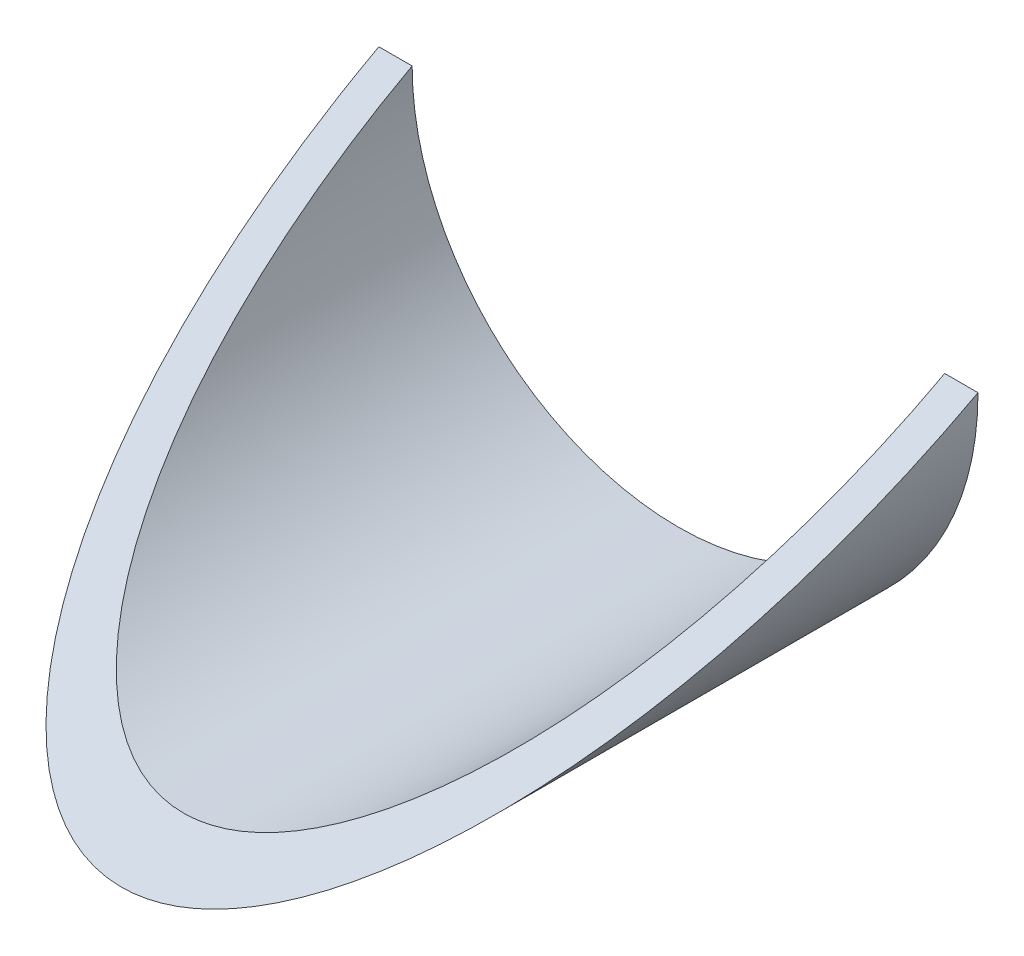
ISO-10303-21;
HEADER;
FILE_DESCRIPTION(('STEP AP214'),'2;1');
FILE_NAME('part.step','',(''),(''),'','','');
FILE_SCHEMA(('AUTOMOTIVE_DESIGN { 1 0 10303 214 1 1 1 1 }'));
ENDSEC;
DATA;
#1=APPLICATION_CONTEXT('core data for automotive mechanical design processes');
#2=APPLICATION_PROTOCOL_DEFINITION('international standard','automotive_design',2000,#1);
#3=PRODUCT_CONTEXT('',#1,'mechanical');
#4=PRODUCT('Part','Part','',(#3));
#5=PRODUCT_RELATED_PRODUCT_CATEGORY('part','',(#4));
#6=PRODUCT_DEFINITION_FORMATION('','',#4);
#7=PRODUCT_DEFINITION_CONTEXT('part definition',#1,'design');
#8=PRODUCT_DEFINITION('design','',#6,#7);
#9=PRODUCT_DEFINITION_SHAPE('','',#8);
#10=(LENGTH_UNIT() NAMED_UNIT(*) SI_UNIT(.MILLI.,.METRE.));
#11=(NAMED_UNIT(*) PLANE_ANGLE_UNIT() SI_UNIT($,.RADIAN.));
#12=(NAMED_UNIT(*) SI_UNIT($,.STERADIAN.) SOLID_ANGLE_UNIT());
#13=UNCERTAINTY_MEASURE_WITH_UNIT(LENGTH_MEASURE(1.E-05),#10,'distance_accuracy_value','');
#14=(GEOMETRIC_REPRESENTATION_CONTEXT(3) GLOBAL_UNCERTAINTY_ASSIGNED_CONTEXT((#13)) GLOBAL_UNIT_ASSIGNED_CONTEXT((#10,
#11,#12)) REPRESENTATION_CONTEXT('',''));
#15=CARTESIAN_POINT('',(0.,0.,0.));
#16=DIRECTION('',(0.,0.,1.));
#17=DIRECTION('',(1.,0.,0.));
#18=AXIS2_PLACEMENT_3D('',#15,#16,#17);
#19=CARTESIAN_POINT('',(0.,0.,-127.));
#20=DIRECTION('',(0.,0.,1.));
#21=DIRECTION('',(1.,0.,0.));
#22=AXIS2_PLACEMENT_3D('',#19,#20,#21);
#23=CYLINDRICAL_SURFACE('',#22,57.15);
#24=CARTESIAN_POINT('',(0.,0.,-106.255823369828));
#25=DIRECTION('',(0.,-0.880694764772711,-0.473684210526316));
#26=DIRECTION('',(0.,-0.473684210526316,0.880694764772711));
#27=AXIS2_PLACEMENT_3D('',#24,#25,#26);
#28=ELLIPSE('',#27,120.65,57.15);
#29=CARTESIAN_POINT('',(-57.15,0.,-106.255823369828));
#30=VERTEX_POINT('',#29);
#31=CARTESIAN_POINT('',(57.15,0.,-106.255823369828));
#32=VERTEX_POINT('',#31);
#33=EDGE_CURVE('E40',#30,#32,#28,.F.);
#34=ORIENTED_EDGE('',*,*,#33,.F.);
#35=CARTESIAN_POINT('',(0.,0.,-106.255823369828));
#36=DIRECTION('',(0.,0.,-1.));
#37=DIRECTION('',(-1.,0.,0.));
#38=AXIS2_PLACEMENT_3D('',#35,#36,#37);
#39=CIRCLE('',#38,57.15);
#40=EDGE_CURVE('E47',#30,#32,#39,.F.);
#41=ORIENTED_EDGE('',*,*,#40,.T.);
#42=EDGE_LOOP('',(#34,#41));
#43=FACE_BOUND('',#42,.T.);
#44=ADVANCED_FACE('F33',(#43),#23,.T.);
#45=CARTESIAN_POINT('',(0.,0.,-127.));
#46=DIRECTION('',(0.,0.,1.));
#47=DIRECTION('',(1.,0.,0.));
#48=AXIS2_PLACEMENT_3D('',#45,#46,#47);
#49=CYLINDRICAL_SURFACE('',#48,50.8);
#50=CARTESIAN_POINT('',(0.,0.,-106.255823369828));
#51=DIRECTION('',(0.,0.,-1.));
#52=DIRECTION('',(-1.,0.,0.));
#53=AXIS2_PLACEMENT_3D('',#50,#51,#52);
#54=CIRCLE('',#53,50.8);
#55=CARTESIAN_POINT('',(-50.8,0.,-106.255823369828));
#56=VERTEX_POINT('',#55);
#57=CARTESIAN_POINT('',(50.8,0.,-106.255823369828));
#58=VERTEX_POINT('',#57);
#59=EDGE_CURVE('E52',#56,#58,#54,.F.);
#60=ORIENTED_EDGE('',*,*,#59,.F.);
#61=CARTESIAN_POINT('',(0.,0.,-106.255823369828));
#62=DIRECTION('',(0.,-0.880694764772711,-0.473684210526316));
#63=DIRECTION('',(0.,-0.473684210526316,0.880694764772711));
#64=AXIS2_PLACEMENT_3D('',#61,#62,#63);
#65=ELLIPSE('',#64,107.244444444444,50.8);
#66=EDGE_CURVE('E11',#56,#58,#65,.F.);
#67=ORIENTED_EDGE('',*,*,#66,.T.);
#68=EDGE_LOOP('',(#60,#67));
#69=FACE_BOUND('',#68,.T.);
#70=ADVANCED_FACE('F70',(#69),#49,.F.);
#71=CARTESIAN_POINT('',(328.396823142788,0.,-106.255823369828));
#72=DIRECTION('',(0.,-0.880694764772711,-0.473684210526316));
#73=DIRECTION('',(0.,0.473684210526316,-0.880694764772711));
#74=AXIS2_PLACEMENT_3D('',#71,#72,#73);
#75=PLANE('',#74);
#76=ORIENTED_EDGE('',*,*,#33,.T.);
#77=DIRECTION('',(-1.,0.,0.));
#78=VECTOR('',#77,1.);
#79=CARTESIAN_POINT('',(328.396823142788,0.,-106.255823369828));
#80=LINE('',#79,#78);
#81=EDGE_CURVE('E62',#32,#58,#80,.T.);
#82=ORIENTED_EDGE('',*,*,#81,.T.);
#83=ORIENTED_EDGE('',*,*,#66,.F.);
#84=EDGE_CURVE('E60',#56,#30,#80,.T.);
#85=ORIENTED_EDGE('',*,*,#84,.T.);
#86=EDGE_LOOP('',(#76,#82,#83,#85));
#87=FACE_BOUND('',#86,.T.);
#88=ADVANCED_FACE('F67',(#87),#75,.F.);
#89=CARTESIAN_POINT('',(-57.15,0.,-106.255823369828));
#90=DIRECTION('',(0.,0.,-1.));
#91=DIRECTION('',(-1.,0.,0.));
#92=AXIS2_PLACEMENT_3D('',#89,#90,#91);
#93=PLANE('',#92);
#94=ORIENTED_EDGE('',*,*,#84,.F.);
#95=ORIENTED_EDGE('',*,*,#59,.T.);
#96=ORIENTED_EDGE('',*,*,#81,.F.);
#97=ORIENTED_EDGE('',*,*,#40,.F.);
#98=EDGE_LOOP('',(#94,#95,#96,#97));
#99=FACE_BOUND('',#98,.T.);
#100=ADVANCED_FACE('F63',(#99),#93,.T.);
#101=CLOSED_SHELL('',(#44,#70,#88,#100));
#102=MANIFOLD_SOLID_BREP('B2',#101);
#103=ADVANCED_BREP_SHAPE_REPRESENTATION('',(#18,#102),#14);
#104=SHAPE_DEFINITION_REPRESENTATION(#9,#103);
ENDSEC;
END-ISO-10303-21;
